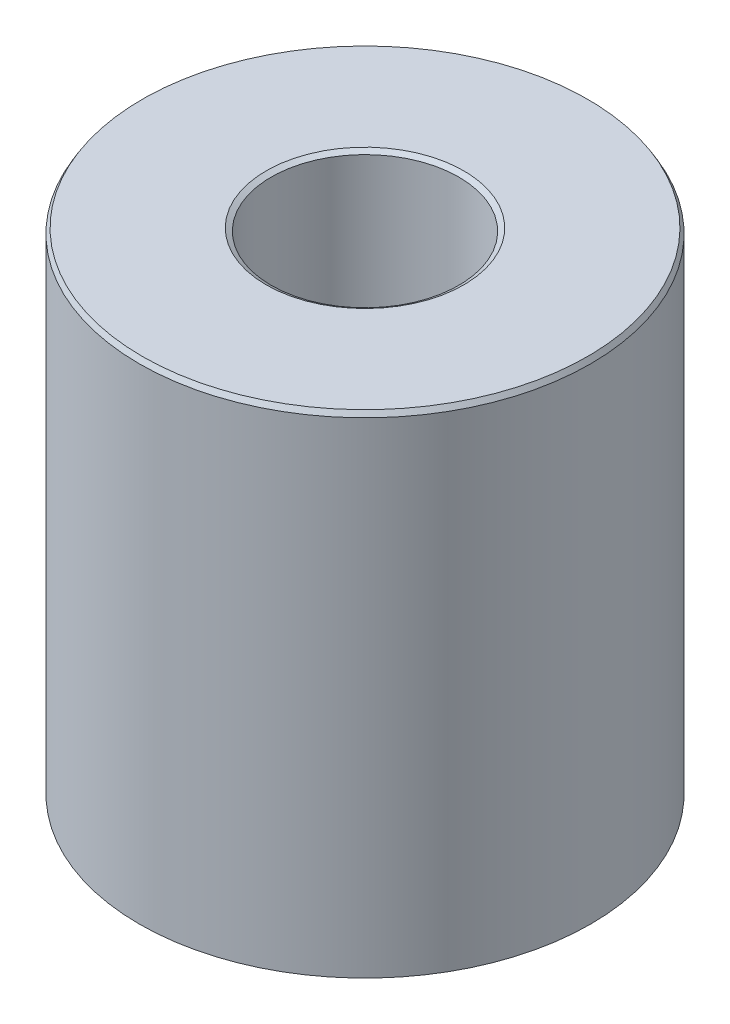
ISO-10303-21;
HEADER;
FILE_DESCRIPTION(('STEP AP214'),'2;1');
FILE_NAME('part.step','',(''),(''),'','','');
FILE_SCHEMA(('AUTOMOTIVE_DESIGN { 1 0 10303 214 1 1 1 1 }'));
ENDSEC;
DATA;
#1=APPLICATION_CONTEXT('core data for automotive mechanical design processes');
#2=APPLICATION_PROTOCOL_DEFINITION('international standard','automotive_design',2000,#1);
#3=PRODUCT_CONTEXT('',#1,'mechanical');
#4=PRODUCT('Part','Part','',(#3));
#5=PRODUCT_RELATED_PRODUCT_CATEGORY('part','',(#4));
#6=PRODUCT_DEFINITION_FORMATION('','',#4);
#7=PRODUCT_DEFINITION_CONTEXT('part definition',#1,'design');
#8=PRODUCT_DEFINITION('design','',#6,#7);
#9=PRODUCT_DEFINITION_SHAPE('','',#8);
#10=(LENGTH_UNIT() NAMED_UNIT(*) SI_UNIT(.MILLI.,.METRE.));
#11=(NAMED_UNIT(*) PLANE_ANGLE_UNIT() SI_UNIT($,.RADIAN.));
#12=(NAMED_UNIT(*) SI_UNIT($,.STERADIAN.) SOLID_ANGLE_UNIT());
#13=UNCERTAINTY_MEASURE_WITH_UNIT(LENGTH_MEASURE(1.E-05),#10,'distance_accuracy_value','');
#14=(GEOMETRIC_REPRESENTATION_CONTEXT(3) GLOBAL_UNCERTAINTY_ASSIGNED_CONTEXT((#13)) GLOBAL_UNIT_ASSIGNED_CONTEXT((#10,
#11,#12)) REPRESENTATION_CONTEXT('',''));
#15=CARTESIAN_POINT('',(0.,0.,0.));
#16=DIRECTION('',(0.,0.,1.));
#17=DIRECTION('',(1.,0.,0.));
#18=AXIS2_PLACEMENT_3D('',#15,#16,#17);
#19=CARTESIAN_POINT('',(0.,60.1070234803184,0.));
#20=DIRECTION('',(0.,-1.,0.));
#21=DIRECTION('',(0.,0.,-1.));
#22=AXIS2_PLACEMENT_3D('',#19,#20,#21);
#23=CYLINDRICAL_SURFACE('',#22,27.5);
#24=CARTESIAN_POINT('',(0.,0.352995868236894,0.));
#25=DIRECTION('',(0.,1.,0.));
#26=DIRECTION('',(0.,0.,1.));
#27=AXIS2_PLACEMENT_3D('',#24,#25,#26);
#28=CIRCLE('',#27,27.5);
#29=CARTESIAN_POINT('',(0.,0.352995868236894,27.5));
#30=VERTEX_POINT('',#29);
#31=EDGE_CURVE('E10',#30,#30,#28,.T.);
#32=ORIENTED_EDGE('',*,*,#31,.T.);
#33=EDGE_LOOP('',(#32));
#34=FACE_BOUND('',#33,.T.);
#35=CARTESIAN_POINT('',(0.,59.4984374801015,0.));
#36=DIRECTION('',(0.,1.,0.));
#37=DIRECTION('',(0.,0.,1.));
#38=AXIS2_PLACEMENT_3D('',#35,#36,#37);
#39=CIRCLE('',#38,27.5);
#40=CARTESIAN_POINT('',(0.,59.4984374801015,27.5));
#41=VERTEX_POINT('',#40);
#42=EDGE_CURVE('E50',#41,#41,#39,.F.);
#43=ORIENTED_EDGE('',*,*,#42,.T.);
#44=EDGE_LOOP('',(#43));
#45=FACE_BOUND('',#44,.T.);
#46=ADVANCED_FACE('F39',(#34,#45),#23,.T.);
#47=CARTESIAN_POINT('',(0.,60.1070234803184,0.));
#48=DIRECTION('',(0.,1.,0.));
#49=DIRECTION('',(0.,0.,1.));
#50=AXIS2_PLACEMENT_3D('',#47,#48,#49);
#51=PLANE('',#50);
#52=CARTESIAN_POINT('',(0.,60.1070234803184,0.));
#53=DIRECTION('',(0.,1.,0.));
#54=DIRECTION('',(0.,0.,1.));
#55=AXIS2_PLACEMENT_3D('',#52,#53,#54);
#56=CIRCLE('',#55,12.0456927480421);
#57=CARTESIAN_POINT('',(0.,60.1070234803184,12.0456927480421));
#58=VERTEX_POINT('',#57);
#59=EDGE_CURVE('E58',#58,#58,#56,.F.);
#60=ORIENTED_EDGE('',*,*,#59,.T.);
#61=EDGE_LOOP('',(#60));
#62=FACE_BOUND('',#61,.T.);
#63=CARTESIAN_POINT('',(0.,60.1070234803184,0.));
#64=DIRECTION('',(0.,1.,0.));
#65=DIRECTION('',(0.,0.,1.));
#66=AXIS2_PLACEMENT_3D('',#63,#64,#65);
#67=CIRCLE('',#66,27.1470041317631);
#68=CARTESIAN_POINT('',(0.,60.1070234803184,27.1470041317631));
#69=VERTEX_POINT('',#68);
#70=EDGE_CURVE('E61',#69,#69,#67,.T.);
#71=ORIENTED_EDGE('',*,*,#70,.T.);
#72=EDGE_LOOP('',(#71));
#73=FACE_BOUND('',#72,.T.);
#74=ADVANCED_FACE('F88',(#62,#73),#51,.T.);
#75=CARTESIAN_POINT('',(0.,0.,0.));
#76=DIRECTION('',(0.,1.,0.));
#77=DIRECTION('',(0.,0.,1.));
#78=AXIS2_PLACEMENT_3D('',#75,#76,#77);
#79=PLANE('',#78);
#80=CARTESIAN_POINT('',(0.,0.,0.));
#81=DIRECTION('',(0.,1.,0.));
#82=DIRECTION('',(0.,0.,1.));
#83=AXIS2_PLACEMENT_3D('',#80,#81,#82);
#84=CIRCLE('',#83,11.7901026160622);
#85=CARTESIAN_POINT('',(0.,0.,11.7901026160622));
#86=VERTEX_POINT('',#85);
#87=EDGE_CURVE('E51',#86,#86,#84,.T.);
#88=ORIENTED_EDGE('',*,*,#87,.T.);
#89=EDGE_LOOP('',(#88));
#90=FACE_BOUND('',#89,.T.);
#91=CARTESIAN_POINT('',(0.,0.,0.));
#92=DIRECTION('',(0.,1.,0.));
#93=DIRECTION('',(0.,0.,1.));
#94=AXIS2_PLACEMENT_3D('',#91,#92,#93);
#95=CIRCLE('',#94,26.8914139997831);
#96=CARTESIAN_POINT('',(0.,0.,26.8914139997831));
#97=VERTEX_POINT('',#96);
#98=EDGE_CURVE('E54',#97,#97,#95,.F.);
#99=ORIENTED_EDGE('',*,*,#98,.T.);
#100=EDGE_LOOP('',(#99));
#101=FACE_BOUND('',#100,.T.);
#102=ADVANCED_FACE('F83',(#90,#101),#79,.F.);
#103=CARTESIAN_POINT('',(0.,60.1070234803184,0.));
#104=DIRECTION('',(0.,-1.,0.));
#105=DIRECTION('',(0.,0.,-1.));
#106=AXIS2_PLACEMENT_3D('',#103,#104,#105);
#107=CYLINDRICAL_SURFACE('',#106,11.4371067478253);
#108=CARTESIAN_POINT('',(0.,59.7540276120815,0.));
#109=DIRECTION('',(0.,1.,0.));
#110=DIRECTION('',(0.,0.,1.));
#111=AXIS2_PLACEMENT_3D('',#108,#109,#110);
#112=CIRCLE('',#111,11.4371067478253);
#113=CARTESIAN_POINT('',(0.,59.7540276120815,11.4371067478253));
#114=VERTEX_POINT('',#113);
#115=EDGE_CURVE('E67',#114,#114,#112,.T.);
#116=ORIENTED_EDGE('',*,*,#115,.T.);
#117=EDGE_LOOP('',(#116));
#118=FACE_BOUND('',#117,.T.);
#119=CARTESIAN_POINT('',(0.,0.60858600021689,0.));
#120=DIRECTION('',(0.,1.,0.));
#121=DIRECTION('',(0.,0.,1.));
#122=AXIS2_PLACEMENT_3D('',#119,#120,#121);
#123=CIRCLE('',#122,11.4371067478253);
#124=CARTESIAN_POINT('',(0.,0.60858600021689,11.4371067478253));
#125=VERTEX_POINT('',#124);
#126=EDGE_CURVE('E69',#125,#125,#123,.F.);
#127=ORIENTED_EDGE('',*,*,#126,.T.);
#128=EDGE_LOOP('',(#127));
#129=FACE_BOUND('',#128,.T.);
#130=ADVANCED_FACE('F71',(#118,#129),#107,.F.);
#131=CARTESIAN_POINT('',(0.,59.7540276120815,0.));
#132=DIRECTION('',(0.,1.,0.));
#133=DIRECTION('',(0.,0.,1.));
#134=AXIS2_PLACEMENT_3D('',#131,#132,#133);
#135=CONICAL_SURFACE('',#134,11.4371067478253,1.04519287549447);
#136=CARTESIAN_POINT('',(0.,60.1070234803184,12.0456927480421));
#137=CARTESIAN_POINT('',(0.,60.1033464400243,12.0393533105399));
#138=CARTESIAN_POINT('',(0.,60.0996693997302,12.0330138730376));
#139=CARTESIAN_POINT('',(0.,60.0923153191419,12.0203349980331));
#140=CARTESIAN_POINT('',(0.,60.0886382788478,12.0139955605308));
#141=CARTESIAN_POINT('',(0.,60.0812841982595,12.0013166855263));
#142=CARTESIAN_POINT('',(0.,60.0776071579654,11.9949772480241));
#143=CARTESIAN_POINT('',(0.,60.0702530773771,11.9822983730195));
#144=CARTESIAN_POINT('',(0.,60.066576037083,11.9759589355173));
#145=CARTESIAN_POINT('',(0.,60.0592219564947,11.9632800605128));
#146=CARTESIAN_POINT('',(0.,60.0555449162006,11.9569406230105));
#147=CARTESIAN_POINT('',(0.,60.0481908356123,11.944261748006));
#148=CARTESIAN_POINT('',(0.,60.0445137953182,11.9379223105037));
#149=CARTESIAN_POINT('',(0.,60.0371597147299,11.9252434354992));
#150=CARTESIAN_POINT('',(0.,60.0334826744358,11.9189039979969));
#151=CARTESIAN_POINT('',(0.,60.0261285938475,11.9062251229924));
#152=CARTESIAN_POINT('',(0.,60.0224515535534,11.8998856854902));
#153=CARTESIAN_POINT('',(0.,60.0150974729651,11.8872068104857));
#154=CARTESIAN_POINT('',(0.,60.011420432671,11.8808673729834));
#155=CARTESIAN_POINT('',(0.,60.0040663520827,11.8681884979789));
#156=CARTESIAN_POINT('',(0.,60.0003893117885,11.8618490604766));
#157=CARTESIAN_POINT('',(0.,59.9930352312003,11.8491701854721));
#158=CARTESIAN_POINT('',(0.,59.9893581909061,11.8428307479698));
#159=CARTESIAN_POINT('',(0.,59.9820041103179,11.8301518729653));
#160=CARTESIAN_POINT('',(0.,59.9783270700237,11.8238124354631));
#161=CARTESIAN_POINT('',(0.,59.9709729894355,11.8111335604585));
#162=CARTESIAN_POINT('',(0.,59.9672959491413,11.8047941229563));
#163=CARTESIAN_POINT('',(0.,59.9599418685531,11.7921152479518));
#164=CARTESIAN_POINT('',(0.,59.9562648282589,11.7857758104495));
#165=CARTESIAN_POINT('',(0.,59.9489107476707,11.773096935445));
#166=CARTESIAN_POINT('',(0.,59.9452337073765,11.7667574979427));
#167=CARTESIAN_POINT('',(0.,59.9378796267883,11.7540786229382));
#168=CARTESIAN_POINT('',(0.,59.9342025864941,11.747739185436));
#169=CARTESIAN_POINT('',(0.,59.9268485059059,11.7350603104314));
#170=CARTESIAN_POINT('',(0.,59.9231714656117,11.7287208729292));
#171=CARTESIAN_POINT('',(0.,59.9158173850235,11.7160419979247));
#172=CARTESIAN_POINT('',(0.,59.9121403447293,11.7097025604224));
#173=CARTESIAN_POINT('',(0.,59.9047862641411,11.6970236854179));
#174=CARTESIAN_POINT('',(0.,59.9011092238469,11.6906842479156));
#175=CARTESIAN_POINT('',(0.,59.8937551432586,11.6780053729111));
#176=CARTESIAN_POINT('',(0.,59.8900781029645,11.6716659354088));
#177=CARTESIAN_POINT('',(0.,59.8827240223762,11.6589870604043));
#178=CARTESIAN_POINT('',(0.,59.8790469820821,11.6526476229021));
#179=CARTESIAN_POINT('',(0.,59.8716929014938,11.6399687478975));
#180=CARTESIAN_POINT('',(0.,59.8680158611997,11.6336293103953));
#181=CARTESIAN_POINT('',(0.,59.8606617806114,11.6209504353908));
#182=CARTESIAN_POINT('',(0.,59.8569847403173,11.6146109978885));
#183=CARTESIAN_POINT('',(0.,59.849630659729,11.601932122884));
#184=CARTESIAN_POINT('',(0.,59.8459536194349,11.5955926853817));
#185=CARTESIAN_POINT('',(0.,59.8385995388466,11.5829138103772));
#186=CARTESIAN_POINT('',(0.,59.8349224985525,11.576574372875));
#187=CARTESIAN_POINT('',(0.,59.8275684179642,11.5638954978704));
#188=CARTESIAN_POINT('',(0.,59.8238913776701,11.5575560603682));
#189=CARTESIAN_POINT('',(0.,59.8165372970818,11.5448771853637));
#190=CARTESIAN_POINT('',(0.,59.8128602567877,11.5385377478614));
#191=CARTESIAN_POINT('',(0.,59.8055061761994,11.5258588728569));
#192=CARTESIAN_POINT('',(0.,59.8018291359053,11.5195194353546));
#193=CARTESIAN_POINT('',(0.,59.794475055317,11.5068405603501));
#194=CARTESIAN_POINT('',(0.,59.7907980150229,11.5005011228478));
#195=CARTESIAN_POINT('',(0.,59.7834439344346,11.4878222478433));
#196=CARTESIAN_POINT('',(0.,59.7797668941405,11.4814828103411));
#197=CARTESIAN_POINT('',(0.,59.7724128135522,11.4688039353365));
#198=CARTESIAN_POINT('',(0.,59.7687357732581,11.4624644978343));
#199=CARTESIAN_POINT('',(0.,59.7613816926698,11.4497856228298));
#200=CARTESIAN_POINT('',(0.,59.7577046523757,11.4434461853275));
#201=CARTESIAN_POINT('',(0.,59.7540276120815,11.4371067478253));
#202=B_SPLINE_CURVE_WITH_KNOTS('',3,(#136,#137,#138,#139,#140,#141,#142,#143,#144,#145,#146,
#147,#148,#149,#150,#151,#152,#153,#154,#155,#156,#157,#158,#159,#160,#161,#162,#163,#164,#165,
#166,#167,#168,#169,#170,#171,#172,#173,#174,#175,#176,#177,#178,#179,#180,#181,#182,#183,#184,
#185,#186,#187,#188,#189,#190,#191,#192,#193,#194,#195,#196,#197,#198,#199,#200,#201),
.UNSPECIFIED.,.F.,.F.,(4,2,2,2,2,2,2,2,2,2,2,2,2,2,2,2,2,2,2,2,2,2,2,2,2,2,2,2,2,2,2,2,4),(0.,
0.021985946386899,0.0439718927737996,0.0659578391606986,0.0879437855475991,0.109929731934498,
0.131915678321399,0.153901624708299,0.175887571095198,0.197873517482099,0.219859463868998,
0.241845410255898,0.263831356642799,0.285817303029698,0.307803249416598,0.329789195803497,
0.351775142190398,0.373761088577298,0.395747034964197,0.417732981351098,0.439718927737997,
0.461704874124897,0.483690820511798,0.505676766898697,0.527662713285598,0.549648659672497,
0.571634606059397,0.593620552446296,0.615606498833197,0.637592445220097,0.659578391606996,
0.681564337993897,0.703550284380796),.UNSPECIFIED.);
#203=EDGE_CURVE('BSEAM77',#58,#114,#202,.T.);
#204=ORIENTED_EDGE('',*,*,#59,.F.);
#205=ORIENTED_EDGE('',*,*,#115,.F.);
#206=ORIENTED_EDGE('',*,*,#203,.T.);
#207=ORIENTED_EDGE('',*,*,#203,.F.);
#208=EDGE_LOOP('',(#204,#206,#205,#207));
#209=FACE_BOUND('',#208,.T.);
#210=ADVANCED_FACE('F77',(#209),#135,.F.);
#211=CARTESIAN_POINT('',(0.,0.,0.));
#212=DIRECTION('',(0.,-1.,0.));
#213=DIRECTION('',(0.,0.,-1.));
#214=AXIS2_PLACEMENT_3D('',#211,#212,#213);
#215=CONICAL_SURFACE('',#214,11.7901026160622,0.525603451300424);
#216=ORIENTED_EDGE('',*,*,#126,.F.);
#217=EDGE_LOOP('',(#216));
#218=FACE_BOUND('',#217,.T.);
#219=ORIENTED_EDGE('',*,*,#87,.F.);
#220=EDGE_LOOP('',(#219));
#221=FACE_BOUND('',#220,.T.);
#222=ADVANCED_FACE('F73',(#218,#221),#215,.F.);
#223=CARTESIAN_POINT('',(0.,0.352995868236894,0.));
#224=DIRECTION('',(0.,1.,0.));
#225=DIRECTION('',(0.,0.,1.));
#226=AXIS2_PLACEMENT_3D('',#223,#224,#225);
#227=CONICAL_SURFACE('',#226,27.5,1.04519287549448);
#228=ORIENTED_EDGE('',*,*,#98,.F.);
#229=EDGE_LOOP('',(#228));
#230=FACE_BOUND('',#229,.T.);
#231=ORIENTED_EDGE('',*,*,#31,.F.);
#232=EDGE_LOOP('',(#231));
#233=FACE_BOUND('',#232,.T.);
#234=ADVANCED_FACE('F76',(#230,#233),#227,.T.);
#235=CARTESIAN_POINT('',(0.,60.1070234803184,0.));
#236=DIRECTION('',(0.,-1.,0.));
#237=DIRECTION('',(0.,0.,-1.));
#238=AXIS2_PLACEMENT_3D('',#235,#236,#237);
#239=CONICAL_SURFACE('',#238,27.1470041317631,0.525603451300421);
#240=ORIENTED_EDGE('',*,*,#42,.F.);
#241=EDGE_LOOP('',(#240));
#242=FACE_BOUND('',#241,.T.);
#243=ORIENTED_EDGE('',*,*,#70,.F.);
#244=EDGE_LOOP('',(#243));
#245=FACE_BOUND('',#244,.T.);
#246=ADVANCED_FACE('F45',(#242,#245),#239,.T.);
#247=CLOSED_SHELL('',(#46,#74,#102,#130,#210,#222,#234,#246));
#248=MANIFOLD_SOLID_BREP('B2',#247);
#249=ADVANCED_BREP_SHAPE_REPRESENTATION('',(#18,#248),#14);
#250=SHAPE_DEFINITION_REPRESENTATION(#9,#249);
ENDSEC;
END-ISO-10303-21;
